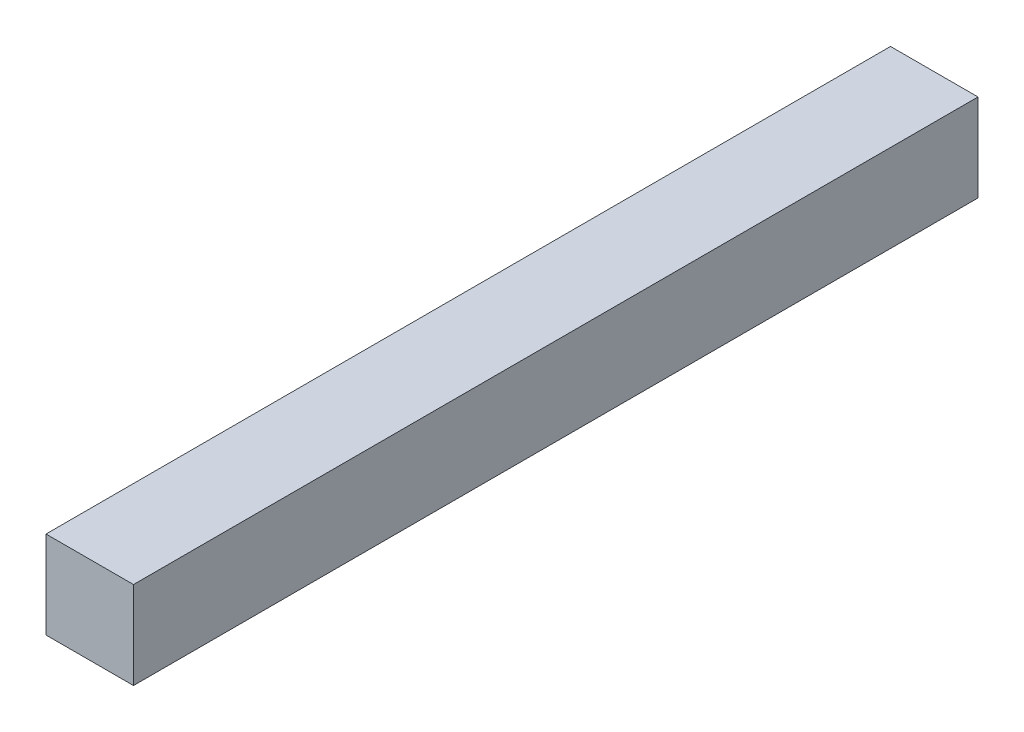
ISO-10303-21;
HEADER;
FILE_DESCRIPTION(('STEP AP214'),'2;1');
FILE_NAME('part.step','',(''),(''),'','','');
FILE_SCHEMA(('AUTOMOTIVE_DESIGN { 1 0 10303 214 1 1 1 1 }'));
ENDSEC;
DATA;
#1=APPLICATION_CONTEXT('core data for automotive mechanical design processes');
#2=APPLICATION_PROTOCOL_DEFINITION('international standard','automotive_design',2000,#1);
#3=PRODUCT_CONTEXT('',#1,'mechanical');
#4=PRODUCT('Part','Part','',(#3));
#5=PRODUCT_RELATED_PRODUCT_CATEGORY('part','',(#4));
#6=PRODUCT_DEFINITION_FORMATION('','',#4);
#7=PRODUCT_DEFINITION_CONTEXT('part definition',#1,'design');
#8=PRODUCT_DEFINITION('design','',#6,#7);
#9=PRODUCT_DEFINITION_SHAPE('','',#8);
#10=(LENGTH_UNIT() NAMED_UNIT(*) SI_UNIT(.MILLI.,.METRE.));
#11=(NAMED_UNIT(*) PLANE_ANGLE_UNIT() SI_UNIT($,.RADIAN.));
#12=(NAMED_UNIT(*) SI_UNIT($,.STERADIAN.) SOLID_ANGLE_UNIT());
#13=UNCERTAINTY_MEASURE_WITH_UNIT(LENGTH_MEASURE(1.E-05),#10,'distance_accuracy_value','');
#14=(GEOMETRIC_REPRESENTATION_CONTEXT(3) GLOBAL_UNCERTAINTY_ASSIGNED_CONTEXT((#13)) GLOBAL_UNIT_ASSIGNED_CONTEXT((#10,
#11,#12)) REPRESENTATION_CONTEXT('',''));
#15=CARTESIAN_POINT('',(0.,0.,0.));
#16=DIRECTION('',(0.,0.,1.));
#17=DIRECTION('',(1.,0.,0.));
#18=AXIS2_PLACEMENT_3D('',#15,#16,#17);
#19=CARTESIAN_POINT('',(0.009999980000003,0.009999980000003,0.));
#20=DIRECTION('',(1.,0.,0.));
#21=DIRECTION('',(0.,0.,-1.));
#22=AXIS2_PLACEMENT_3D('',#19,#20,#21);
#23=PLANE('',#22);
#24=DIRECTION('',(0.,0.,-1.));
#25=VECTOR('',#24,1.);
#26=CARTESIAN_POINT('',(0.009999980000003,0.,0.));
#27=LINE('',#26,#25);
#28=CARTESIAN_POINT('',(0.009999980000003,0.,0.));
#29=VERTEX_POINT('',#28);
#30=CARTESIAN_POINT('',(0.009999980000003,0.,0.09652));
#31=VERTEX_POINT('',#30);
#32=EDGE_CURVE('E19',#29,#31,#27,.F.);
#33=ORIENTED_EDGE('',*,*,#32,.F.);
#34=DIRECTION('',(0.,1.,0.));
#35=VECTOR('',#34,1.);
#36=CARTESIAN_POINT('',(0.009999980000003,0.,0.));
#37=LINE('',#36,#35);
#38=CARTESIAN_POINT('',(0.009999980000003,0.009999980000003,0.));
#39=VERTEX_POINT('',#38);
#40=EDGE_CURVE('E79',#29,#39,#37,.T.);
#41=ORIENTED_EDGE('',*,*,#40,.T.);
#42=DIRECTION('',(0.,0.,1.));
#43=VECTOR('',#42,1.);
#44=CARTESIAN_POINT('',(0.009999980000003,0.009999980000003,0.));
#45=LINE('',#44,#43);
#46=CARTESIAN_POINT('',(0.009999980000003,0.009999980000003,0.09652));
#47=VERTEX_POINT('',#46);
#48=EDGE_CURVE('E67',#47,#39,#45,.F.);
#49=ORIENTED_EDGE('',*,*,#48,.F.);
#50=DIRECTION('',(0.,1.,0.));
#51=VECTOR('',#50,1.);
#52=CARTESIAN_POINT('',(0.009999980000003,0.,0.09652));
#53=LINE('',#52,#51);
#54=EDGE_CURVE('E55',#31,#47,#53,.T.);
#55=ORIENTED_EDGE('',*,*,#54,.F.);
#56=EDGE_LOOP('',(#33,#41,#49,#55));
#57=FACE_BOUND('',#56,.T.);
#58=ADVANCED_FACE('F16',(#57),#23,.T.);
#59=CARTESIAN_POINT('',(0.009999980000003,0.,0.));
#60=DIRECTION('',(0.,-1.,0.));
#61=DIRECTION('',(0.,0.,-1.));
#62=AXIS2_PLACEMENT_3D('',#59,#60,#61);
#63=PLANE('',#62);
#64=DIRECTION('',(0.,0.,1.));
#65=VECTOR('',#64,1.);
#66=CARTESIAN_POINT('',(0.,0.,0.));
#67=LINE('',#66,#65);
#68=CARTESIAN_POINT('',(0.,0.,0.));
#69=VERTEX_POINT('',#68);
#70=CARTESIAN_POINT('',(0.,0.,0.09652));
#71=VERTEX_POINT('',#70);
#72=EDGE_CURVE('E82',#69,#71,#67,.T.);
#73=ORIENTED_EDGE('',*,*,#72,.F.);
#74=DIRECTION('',(1.,0.,0.));
#75=VECTOR('',#74,1.);
#76=CARTESIAN_POINT('',(0.,0.,0.));
#77=LINE('',#76,#75);
#78=EDGE_CURVE('E64',#69,#29,#77,.T.);
#79=ORIENTED_EDGE('',*,*,#78,.T.);
#80=ORIENTED_EDGE('',*,*,#32,.T.);
#81=DIRECTION('',(1.,0.,0.));
#82=VECTOR('',#81,1.);
#83=CARTESIAN_POINT('',(0.,0.,0.09652));
#84=LINE('',#83,#82);
#85=EDGE_CURVE('E61',#71,#31,#84,.T.);
#86=ORIENTED_EDGE('',*,*,#85,.F.);
#87=EDGE_LOOP('',(#73,#79,#80,#86));
#88=FACE_BOUND('',#87,.T.);
#89=ADVANCED_FACE('F60',(#88),#63,.T.);
#90=CARTESIAN_POINT('',(0.,0.,0.09652));
#91=DIRECTION('',(0.,0.,1.));
#92=DIRECTION('',(1.,0.,0.));
#93=AXIS2_PLACEMENT_3D('',#90,#91,#92);
#94=PLANE('',#93);
#95=DIRECTION('',(1.,0.,0.));
#96=VECTOR('',#95,1.);
#97=CARTESIAN_POINT('',(0.,0.009999980000003,0.09652));
#98=LINE('',#97,#96);
#99=CARTESIAN_POINT('',(0.,0.009999980000003,0.09652));
#100=VERTEX_POINT('',#99);
#101=EDGE_CURVE('E69',#100,#47,#98,.T.);
#102=ORIENTED_EDGE('',*,*,#101,.F.);
#103=DIRECTION('',(0.,1.,0.));
#104=VECTOR('',#103,1.);
#105=CARTESIAN_POINT('',(0.,0.,0.09652));
#106=LINE('',#105,#104);
#107=EDGE_CURVE('E73',#71,#100,#106,.T.);
#108=ORIENTED_EDGE('',*,*,#107,.F.);
#109=ORIENTED_EDGE('',*,*,#85,.T.);
#110=ORIENTED_EDGE('',*,*,#54,.T.);
#111=EDGE_LOOP('',(#102,#108,#109,#110));
#112=FACE_BOUND('',#111,.T.);
#113=ADVANCED_FACE('F71',(#112),#94,.T.);
#114=CARTESIAN_POINT('',(0.,0.009999980000003,0.));
#115=DIRECTION('',(0.,1.,0.));
#116=DIRECTION('',(0.,0.,1.));
#117=AXIS2_PLACEMENT_3D('',#114,#115,#116);
#118=PLANE('',#117);
#119=ORIENTED_EDGE('',*,*,#48,.T.);
#120=DIRECTION('',(1.,0.,0.));
#121=VECTOR('',#120,1.);
#122=CARTESIAN_POINT('',(0.,0.009999980000003,0.));
#123=LINE('',#122,#121);
#124=CARTESIAN_POINT('',(0.,0.009999980000003,0.));
#125=VERTEX_POINT('',#124);
#126=EDGE_CURVE('E34',#39,#125,#123,.F.);
#127=ORIENTED_EDGE('',*,*,#126,.T.);
#128=DIRECTION('',(0.,0.,1.));
#129=VECTOR('',#128,1.);
#130=CARTESIAN_POINT('',(0.,0.009999980000003,0.));
#131=LINE('',#130,#129);
#132=EDGE_CURVE('E25',#100,#125,#131,.F.);
#133=ORIENTED_EDGE('',*,*,#132,.F.);
#134=ORIENTED_EDGE('',*,*,#101,.T.);
#135=EDGE_LOOP('',(#119,#127,#133,#134));
#136=FACE_BOUND('',#135,.T.);
#137=ADVANCED_FACE('F88',(#136),#118,.T.);
#138=CARTESIAN_POINT('',(0.,0.,0.));
#139=DIRECTION('',(0.,0.,1.));
#140=DIRECTION('',(1.,0.,0.));
#141=AXIS2_PLACEMENT_3D('',#138,#139,#140);
#142=PLANE('',#141);
#143=ORIENTED_EDGE('',*,*,#126,.F.);
#144=ORIENTED_EDGE('',*,*,#40,.F.);
#145=ORIENTED_EDGE('',*,*,#78,.F.);
#146=DIRECTION('',(0.,1.,0.));
#147=VECTOR('',#146,1.);
#148=CARTESIAN_POINT('',(0.,0.,0.));
#149=LINE('',#148,#147);
#150=EDGE_CURVE('E10',#125,#69,#149,.F.);
#151=ORIENTED_EDGE('',*,*,#150,.F.);
#152=EDGE_LOOP('',(#143,#144,#145,#151));
#153=FACE_BOUND('',#152,.T.);
#154=ADVANCED_FACE('F90',(#153),#142,.F.);
#155=CARTESIAN_POINT('',(0.,0.,0.));
#156=DIRECTION('',(-1.,0.,0.));
#157=DIRECTION('',(0.,0.,1.));
#158=AXIS2_PLACEMENT_3D('',#155,#156,#157);
#159=PLANE('',#158);
#160=ORIENTED_EDGE('',*,*,#132,.T.);
#161=ORIENTED_EDGE('',*,*,#150,.T.);
#162=ORIENTED_EDGE('',*,*,#72,.T.);
#163=ORIENTED_EDGE('',*,*,#107,.T.);
#164=EDGE_LOOP('',(#160,#161,#162,#163));
#165=FACE_BOUND('',#164,.T.);
#166=ADVANCED_FACE('F87',(#165),#159,.T.);
#167=CLOSED_SHELL('',(#58,#89,#113,#137,#154,#166));
#168=MANIFOLD_SOLID_BREP('B1',#167);
#169=ADVANCED_BREP_SHAPE_REPRESENTATION('',(#18,#168),#14);
#170=SHAPE_DEFINITION_REPRESENTATION(#9,#169);
ENDSEC;
END-ISO-10303-21;
